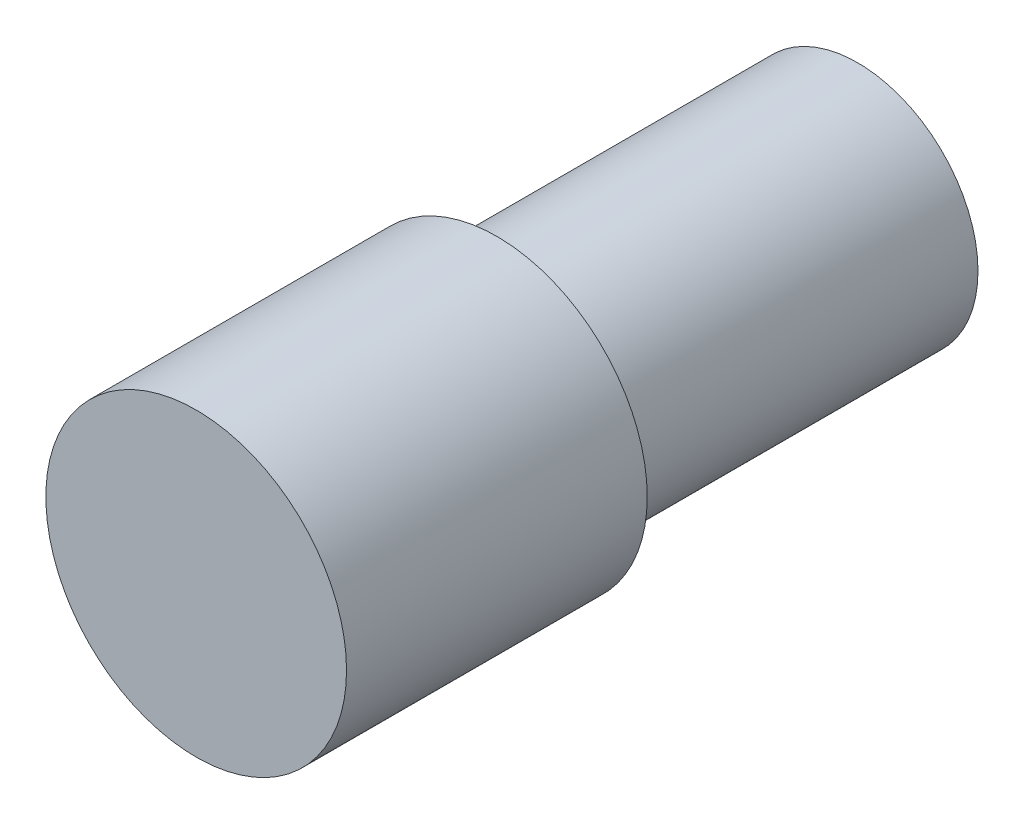
ISO-10303-21;
HEADER;
FILE_DESCRIPTION(('STEP AP214'),'2;1');
FILE_NAME('part.step','',(''),(''),'','','');
FILE_SCHEMA(('AUTOMOTIVE_DESIGN { 1 0 10303 214 1 1 1 1 }'));
ENDSEC;
DATA;
#1=APPLICATION_CONTEXT('core data for automotive mechanical design processes');
#2=APPLICATION_PROTOCOL_DEFINITION('international standard','automotive_design',2000,#1);
#3=PRODUCT_CONTEXT('',#1,'mechanical');
#4=PRODUCT('Part','Part','',(#3));
#5=PRODUCT_RELATED_PRODUCT_CATEGORY('part','',(#4));
#6=PRODUCT_DEFINITION_FORMATION('','',#4);
#7=PRODUCT_DEFINITION_CONTEXT('part definition',#1,'design');
#8=PRODUCT_DEFINITION('design','',#6,#7);
#9=PRODUCT_DEFINITION_SHAPE('','',#8);
#10=(LENGTH_UNIT() NAMED_UNIT(*) SI_UNIT(.MILLI.,.METRE.));
#11=(NAMED_UNIT(*) PLANE_ANGLE_UNIT() SI_UNIT($,.RADIAN.));
#12=(NAMED_UNIT(*) SI_UNIT($,.STERADIAN.) SOLID_ANGLE_UNIT());
#13=UNCERTAINTY_MEASURE_WITH_UNIT(LENGTH_MEASURE(1.E-05),#10,'distance_accuracy_value','');
#14=(GEOMETRIC_REPRESENTATION_CONTEXT(3) GLOBAL_UNCERTAINTY_ASSIGNED_CONTEXT((#13)) GLOBAL_UNIT_ASSIGNED_CONTEXT((#10,
#11,#12)) REPRESENTATION_CONTEXT('',''));
#15=CARTESIAN_POINT('',(0.,0.,0.));
#16=DIRECTION('',(0.,0.,1.));
#17=DIRECTION('',(1.,0.,0.));
#18=AXIS2_PLACEMENT_3D('',#15,#16,#17);
#19=CARTESIAN_POINT('',(0.,0.,10.));
#20=DIRECTION('',(0.,0.,-1.));
#21=DIRECTION('',(-1.,0.,0.));
#22=AXIS2_PLACEMENT_3D('',#19,#20,#21);
#23=CYLINDRICAL_SURFACE('',#22,5.);
#24=CARTESIAN_POINT('',(0.,0.,10.));
#25=DIRECTION('',(0.,0.,1.));
#26=DIRECTION('',(1.,0.,0.));
#27=AXIS2_PLACEMENT_3D('',#24,#25,#26);
#28=CIRCLE('',#27,5.);
#29=CARTESIAN_POINT('',(5.,0.,10.));
#30=VERTEX_POINT('',#29);
#31=EDGE_CURVE('E45',#30,#30,#28,.T.);
#32=ORIENTED_EDGE('',*,*,#31,.F.);
#33=EDGE_LOOP('',(#32));
#34=FACE_BOUND('',#33,.T.);
#35=CARTESIAN_POINT('',(0.,0.,0.));
#36=DIRECTION('',(0.,0.,1.));
#37=DIRECTION('',(1.,0.,0.));
#38=AXIS2_PLACEMENT_3D('',#35,#36,#37);
#39=CIRCLE('',#38,5.);
#40=CARTESIAN_POINT('',(5.,0.,0.));
#41=VERTEX_POINT('',#40);
#42=EDGE_CURVE('E40',#41,#41,#39,.T.);
#43=ORIENTED_EDGE('',*,*,#42,.T.);
#44=EDGE_LOOP('',(#43));
#45=FACE_BOUND('',#44,.T.);
#46=ADVANCED_FACE('F37',(#34,#45),#23,.T.);
#47=CARTESIAN_POINT('',(0.,0.,10.));
#48=DIRECTION('',(0.,0.,1.));
#49=DIRECTION('',(1.,0.,0.));
#50=AXIS2_PLACEMENT_3D('',#47,#48,#49);
#51=PLANE('',#50);
#52=ORIENTED_EDGE('',*,*,#31,.T.);
#53=EDGE_LOOP('',(#52));
#54=FACE_BOUND('',#53,.T.);
#55=ADVANCED_FACE('F65',(#54),#51,.T.);
#56=CARTESIAN_POINT('',(0.,0.,0.));
#57=DIRECTION('',(0.,0.,1.));
#58=DIRECTION('',(1.,0.,0.));
#59=AXIS2_PLACEMENT_3D('',#56,#57,#58);
#60=PLANE('',#59);
#61=CARTESIAN_POINT('',(0.,0.,0.));
#62=DIRECTION('',(0.,0.,-1.));
#63=DIRECTION('',(-1.,0.,0.));
#64=AXIS2_PLACEMENT_3D('',#61,#62,#63);
#65=CIRCLE('',#64,4.);
#66=CARTESIAN_POINT('',(-4.,0.,0.));
#67=VERTEX_POINT('',#66);
#68=EDGE_CURVE('E10',#67,#67,#65,.T.);
#69=ORIENTED_EDGE('',*,*,#68,.F.);
#70=EDGE_LOOP('',(#69));
#71=FACE_BOUND('',#70,.T.);
#72=ORIENTED_EDGE('',*,*,#42,.F.);
#73=EDGE_LOOP('',(#72));
#74=FACE_BOUND('',#73,.T.);
#75=ADVANCED_FACE('F62',(#71,#74),#60,.F.);
#76=CARTESIAN_POINT('',(0.,0.,-12.));
#77=DIRECTION('',(0.,0.,1.));
#78=DIRECTION('',(1.,0.,0.));
#79=AXIS2_PLACEMENT_3D('',#76,#77,#78);
#80=CYLINDRICAL_SURFACE('',#79,4.);
#81=CARTESIAN_POINT('',(0.,0.,-12.));
#82=DIRECTION('',(0.,0.,-1.));
#83=DIRECTION('',(-1.,0.,0.));
#84=AXIS2_PLACEMENT_3D('',#81,#82,#83);
#85=CIRCLE('',#84,4.);
#86=CARTESIAN_POINT('',(-4.,0.,-12.));
#87=VERTEX_POINT('',#86);
#88=EDGE_CURVE('E52',#87,#87,#85,.T.);
#89=ORIENTED_EDGE('',*,*,#88,.F.);
#90=EDGE_LOOP('',(#89));
#91=FACE_BOUND('',#90,.T.);
#92=ORIENTED_EDGE('',*,*,#68,.T.);
#93=EDGE_LOOP('',(#92));
#94=FACE_BOUND('',#93,.T.);
#95=ADVANCED_FACE('F64',(#91,#94),#80,.T.);
#96=CARTESIAN_POINT('',(0.,0.,-12.));
#97=DIRECTION('',(0.,0.,-1.));
#98=DIRECTION('',(-1.,0.,0.));
#99=AXIS2_PLACEMENT_3D('',#96,#97,#98);
#100=PLANE('',#99);
#101=ORIENTED_EDGE('',*,*,#88,.T.);
#102=EDGE_LOOP('',(#101));
#103=FACE_BOUND('',#102,.T.);
#104=ADVANCED_FACE('F71',(#103),#100,.T.);
#105=CLOSED_SHELL('',(#46,#55,#75,#95,#104));
#106=MANIFOLD_SOLID_BREP('B2',#105);
#107=ADVANCED_BREP_SHAPE_REPRESENTATION('',(#18,#106),#14);
#108=SHAPE_DEFINITION_REPRESENTATION(#9,#107);
ENDSEC;
END-ISO-10303-21;
